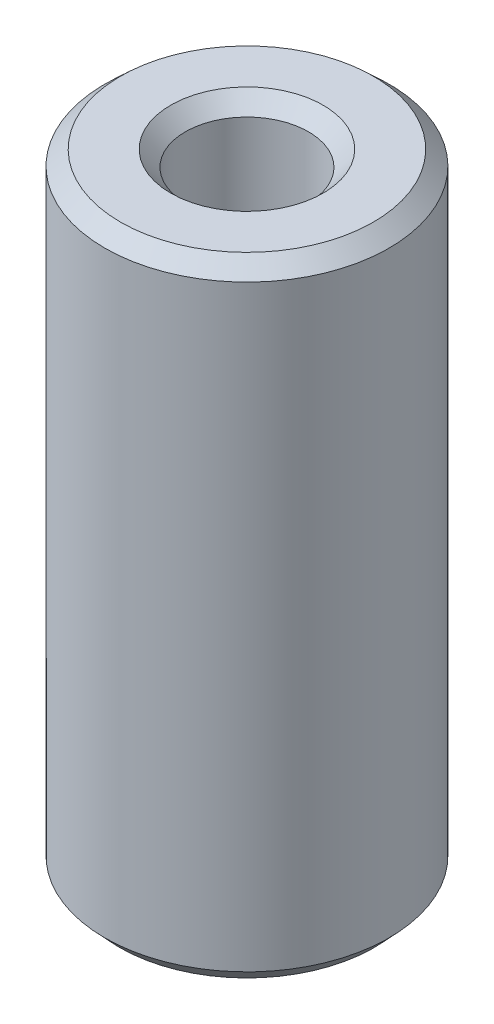
ISO-10303-21;
HEADER;
FILE_DESCRIPTION(('STEP AP214'),'2;1');
FILE_NAME('part.step','',(''),(''),'','','');
FILE_SCHEMA(('AUTOMOTIVE_DESIGN { 1 0 10303 214 1 1 1 1 }'));
ENDSEC;
DATA;
#1=APPLICATION_CONTEXT('core data for automotive mechanical design processes');
#2=APPLICATION_PROTOCOL_DEFINITION('international standard','automotive_design',2000,#1);
#3=PRODUCT_CONTEXT('',#1,'mechanical');
#4=PRODUCT('Part','Part','',(#3));
#5=PRODUCT_RELATED_PRODUCT_CATEGORY('part','',(#4));
#6=PRODUCT_DEFINITION_FORMATION('','',#4);
#7=PRODUCT_DEFINITION_CONTEXT('part definition',#1,'design');
#8=PRODUCT_DEFINITION('design','',#6,#7);
#9=PRODUCT_DEFINITION_SHAPE('','',#8);
#10=(LENGTH_UNIT() NAMED_UNIT(*) SI_UNIT(.MILLI.,.METRE.));
#11=(NAMED_UNIT(*) PLANE_ANGLE_UNIT() SI_UNIT($,.RADIAN.));
#12=(NAMED_UNIT(*) SI_UNIT($,.STERADIAN.) SOLID_ANGLE_UNIT());
#13=UNCERTAINTY_MEASURE_WITH_UNIT(LENGTH_MEASURE(1.E-05),#10,'distance_accuracy_value','');
#14=(GEOMETRIC_REPRESENTATION_CONTEXT(3) GLOBAL_UNCERTAINTY_ASSIGNED_CONTEXT((#13)) GLOBAL_UNIT_ASSIGNED_CONTEXT((#10,
#11,#12)) REPRESENTATION_CONTEXT('',''));
#15=CARTESIAN_POINT('',(0.,0.,0.));
#16=DIRECTION('',(0.,0.,1.));
#17=DIRECTION('',(1.,0.,0.));
#18=AXIS2_PLACEMENT_3D('',#15,#16,#17);
#19=CARTESIAN_POINT('',(0.,143.563032072903,0.));
#20=DIRECTION('',(0.,-1.,0.));
#21=DIRECTION('',(0.,0.,-1.));
#22=AXIS2_PLACEMENT_3D('',#19,#20,#21);
#23=CYLINDRICAL_SURFACE('',#22,32.5);
#24=CARTESIAN_POINT('',(0.,3.58659116977444,0.));
#25=DIRECTION('',(0.,1.,0.));
#26=DIRECTION('',(0.,0.,1.));
#27=AXIS2_PLACEMENT_3D('',#24,#25,#26);
#28=CIRCLE('',#27,32.5);
#29=CARTESIAN_POINT('',(0.,3.58659116977444,32.5));
#30=VERTEX_POINT('',#29);
#31=EDGE_CURVE('E10',#30,#30,#28,.T.);
#32=ORIENTED_EDGE('',*,*,#31,.T.);
#33=EDGE_LOOP('',(#32));
#34=FACE_BOUND('',#33,.T.);
#35=CARTESIAN_POINT('',(0.,140.204631093567,0.));
#36=DIRECTION('',(0.,1.,0.));
#37=DIRECTION('',(0.,0.,1.));
#38=AXIS2_PLACEMENT_3D('',#35,#36,#37);
#39=CIRCLE('',#38,32.5);
#40=CARTESIAN_POINT('',(0.,140.204631093567,32.5));
#41=VERTEX_POINT('',#40);
#42=EDGE_CURVE('E50',#41,#41,#39,.F.);
#43=ORIENTED_EDGE('',*,*,#42,.T.);
#44=EDGE_LOOP('',(#43));
#45=FACE_BOUND('',#44,.T.);
#46=ADVANCED_FACE('F39',(#34,#45),#23,.T.);
#47=CARTESIAN_POINT('',(0.,143.563032072903,0.));
#48=DIRECTION('',(0.,1.,0.));
#49=DIRECTION('',(0.,0.,1.));
#50=AXIS2_PLACEMENT_3D('',#47,#48,#49);
#51=PLANE('',#50);
#52=CARTESIAN_POINT('',(0.,143.563032072903,0.));
#53=DIRECTION('',(0.,1.,0.));
#54=DIRECTION('',(0.,0.,1.));
#55=AXIS2_PLACEMENT_3D('',#52,#53,#54);
#56=CIRCLE('',#55,17.4352857722972);
#57=CARTESIAN_POINT('',(0.,143.563032072903,17.4352857722972));
#58=VERTEX_POINT('',#57);
#59=EDGE_CURVE('E58',#58,#58,#56,.F.);
#60=ORIENTED_EDGE('',*,*,#59,.T.);
#61=EDGE_LOOP('',(#60));
#62=FACE_BOUND('',#61,.T.);
#63=CARTESIAN_POINT('',(0.,143.563032072903,0.));
#64=DIRECTION('',(0.,1.,0.));
#65=DIRECTION('',(0.,0.,1.));
#66=AXIS2_PLACEMENT_3D('',#63,#64,#65);
#67=CIRCLE('',#66,28.9134088302256);
#68=CARTESIAN_POINT('',(0.,143.563032072903,28.9134088302256));
#69=VERTEX_POINT('',#68);
#70=EDGE_CURVE('E61',#69,#69,#67,.T.);
#71=ORIENTED_EDGE('',*,*,#70,.T.);
#72=EDGE_LOOP('',(#71));
#73=FACE_BOUND('',#72,.T.);
#74=ADVANCED_FACE('F88',(#62,#73),#51,.T.);
#75=CARTESIAN_POINT('',(0.,0.,0.));
#76=DIRECTION('',(0.,1.,0.));
#77=DIRECTION('',(0.,0.,1.));
#78=AXIS2_PLACEMENT_3D('',#75,#76,#77);
#79=PLANE('',#78);
#80=CARTESIAN_POINT('',(0.,0.,0.));
#81=DIRECTION('',(0.,1.,0.));
#82=DIRECTION('',(0.,0.,1.));
#83=AXIS2_PLACEMENT_3D('',#80,#81,#82);
#84=CIRCLE('',#83,17.6634759627357);
#85=CARTESIAN_POINT('',(0.,0.,17.6634759627357));
#86=VERTEX_POINT('',#85);
#87=EDGE_CURVE('E51',#86,#86,#84,.T.);
#88=ORIENTED_EDGE('',*,*,#87,.T.);
#89=EDGE_LOOP('',(#88));
#90=FACE_BOUND('',#89,.T.);
#91=CARTESIAN_POINT('',(0.,0.,0.));
#92=DIRECTION('',(0.,1.,0.));
#93=DIRECTION('',(0.,0.,1.));
#94=AXIS2_PLACEMENT_3D('',#91,#92,#93);
#95=CIRCLE('',#94,29.1415990206641);
#96=CARTESIAN_POINT('',(0.,0.,29.1415990206641));
#97=VERTEX_POINT('',#96);
#98=EDGE_CURVE('E54',#97,#97,#95,.F.);
#99=ORIENTED_EDGE('',*,*,#98,.T.);
#100=EDGE_LOOP('',(#99));
#101=FACE_BOUND('',#100,.T.);
#102=ADVANCED_FACE('F83',(#90,#101),#79,.F.);
#103=CARTESIAN_POINT('',(0.,143.563032072903,0.));
#104=DIRECTION('',(0.,-1.,0.));
#105=DIRECTION('',(0.,0.,-1.));
#106=AXIS2_PLACEMENT_3D('',#103,#104,#105);
#107=CYLINDRICAL_SURFACE('',#106,14.0768847929612);
#108=CARTESIAN_POINT('',(0.,139.976440903129,0.));
#109=DIRECTION('',(0.,1.,0.));
#110=DIRECTION('',(0.,0.,1.));
#111=AXIS2_PLACEMENT_3D('',#108,#109,#110);
#112=CIRCLE('',#111,14.0768847929612);
#113=CARTESIAN_POINT('',(0.,139.976440903129,14.0768847929612));
#114=VERTEX_POINT('',#113);
#115=EDGE_CURVE('E67',#114,#114,#112,.T.);
#116=ORIENTED_EDGE('',*,*,#115,.T.);
#117=EDGE_LOOP('',(#116));
#118=FACE_BOUND('',#117,.T.);
#119=CARTESIAN_POINT('',(0.,3.35840097933596,0.));
#120=DIRECTION('',(0.,1.,0.));
#121=DIRECTION('',(0.,0.,1.));
#122=AXIS2_PLACEMENT_3D('',#119,#120,#121);
#123=CIRCLE('',#122,14.0768847929612);
#124=CARTESIAN_POINT('',(0.,3.35840097933596,14.0768847929612));
#125=VERTEX_POINT('',#124);
#126=EDGE_CURVE('E69',#125,#125,#123,.F.);
#127=ORIENTED_EDGE('',*,*,#126,.T.);
#128=EDGE_LOOP('',(#127));
#129=FACE_BOUND('',#128,.T.);
#130=ADVANCED_FACE('F71',(#118,#129),#107,.F.);
#131=CARTESIAN_POINT('',(0.,139.976440903129,0.));
#132=DIRECTION('',(0.,1.,0.));
#133=DIRECTION('',(0.,0.,1.));
#134=AXIS2_PLACEMENT_3D('',#131,#132,#133);
#135=CONICAL_SURFACE('',#134,14.0768847929612,0.752553183446272);
#136=ORIENTED_EDGE('',*,*,#59,.F.);
#137=EDGE_LOOP('',(#136));
#138=FACE_BOUND('',#137,.T.);
#139=ORIENTED_EDGE('',*,*,#115,.F.);
#140=EDGE_LOOP('',(#139));
#141=FACE_BOUND('',#140,.T.);
#142=ADVANCED_FACE('F77',(#138,#141),#135,.F.);
#143=CARTESIAN_POINT('',(0.,0.,0.));
#144=DIRECTION('',(0.,-1.,0.));
#145=DIRECTION('',(0.,0.,-1.));
#146=AXIS2_PLACEMENT_3D('',#143,#144,#145);
#147=CONICAL_SURFACE('',#146,17.6634759627357,0.818243143348621);
#148=ORIENTED_EDGE('',*,*,#126,.F.);
#149=EDGE_LOOP('',(#148));
#150=FACE_BOUND('',#149,.T.);
#151=ORIENTED_EDGE('',*,*,#87,.F.);
#152=EDGE_LOOP('',(#151));
#153=FACE_BOUND('',#152,.T.);
#154=ADVANCED_FACE('F73',(#150,#153),#147,.F.);
#155=CARTESIAN_POINT('',(0.,3.58659116977444,0.));
#156=DIRECTION('',(0.,1.,0.));
#157=DIRECTION('',(0.,0.,1.));
#158=AXIS2_PLACEMENT_3D('',#155,#156,#157);
#159=CONICAL_SURFACE('',#158,32.5,0.752553183446274);
#160=ORIENTED_EDGE('',*,*,#98,.F.);
#161=EDGE_LOOP('',(#160));
#162=FACE_BOUND('',#161,.T.);
#163=ORIENTED_EDGE('',*,*,#31,.F.);
#164=EDGE_LOOP('',(#163));
#165=FACE_BOUND('',#164,.T.);
#166=ADVANCED_FACE('F76',(#162,#165),#159,.T.);
#167=CARTESIAN_POINT('',(0.,143.563032072903,0.));
#168=DIRECTION('',(0.,-1.,0.));
#169=DIRECTION('',(0.,0.,-1.));
#170=AXIS2_PLACEMENT_3D('',#167,#168,#169);
#171=CONICAL_SURFACE('',#170,28.9134088302256,0.818243143348617);
#172=ORIENTED_EDGE('',*,*,#42,.F.);
#173=EDGE_LOOP('',(#172));
#174=FACE_BOUND('',#173,.T.);
#175=ORIENTED_EDGE('',*,*,#70,.F.);
#176=EDGE_LOOP('',(#175));
#177=FACE_BOUND('',#176,.T.);
#178=ADVANCED_FACE('F45',(#174,#177),#171,.T.);
#179=CLOSED_SHELL('',(#46,#74,#102,#130,#142,#154,#166,#178));
#180=MANIFOLD_SOLID_BREP('B2',#179);
#181=ADVANCED_BREP_SHAPE_REPRESENTATION('',(#18,#180),#14);
#182=SHAPE_DEFINITION_REPRESENTATION(#9,#181);
ENDSEC;
END-ISO-10303-21;
